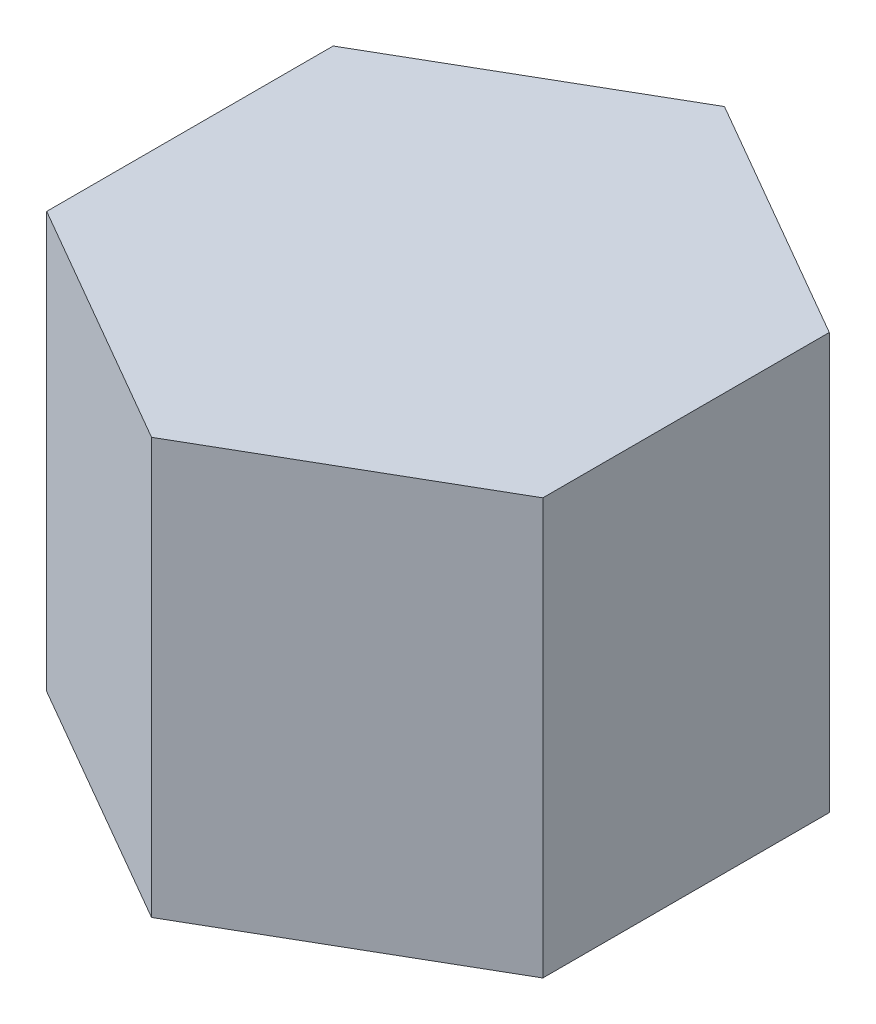
ISO-10303-21;
HEADER;
FILE_DESCRIPTION(('STEP AP214'),'2;1');
FILE_NAME('part.step','',(''),(''),'','','');
FILE_SCHEMA(('AUTOMOTIVE_DESIGN { 1 0 10303 214 1 1 1 1 }'));
ENDSEC;
DATA;
#1=APPLICATION_CONTEXT('core data for automotive mechanical design processes');
#2=APPLICATION_PROTOCOL_DEFINITION('international standard','automotive_design',2000,#1);
#3=PRODUCT_CONTEXT('',#1,'mechanical');
#4=PRODUCT('Part','Part','',(#3));
#5=PRODUCT_RELATED_PRODUCT_CATEGORY('part','',(#4));
#6=PRODUCT_DEFINITION_FORMATION('','',#4);
#7=PRODUCT_DEFINITION_CONTEXT('part definition',#1,'design');
#8=PRODUCT_DEFINITION('design','',#6,#7);
#9=PRODUCT_DEFINITION_SHAPE('','',#8);
#10=(LENGTH_UNIT() NAMED_UNIT(*) SI_UNIT(.MILLI.,.METRE.));
#11=(NAMED_UNIT(*) PLANE_ANGLE_UNIT() SI_UNIT($,.RADIAN.));
#12=(NAMED_UNIT(*) SI_UNIT($,.STERADIAN.) SOLID_ANGLE_UNIT());
#13=UNCERTAINTY_MEASURE_WITH_UNIT(LENGTH_MEASURE(1.E-05),#10,'distance_accuracy_value','');
#14=(GEOMETRIC_REPRESENTATION_CONTEXT(3) GLOBAL_UNCERTAINTY_ASSIGNED_CONTEXT((#13)) GLOBAL_UNIT_ASSIGNED_CONTEXT((#10,
#11,#12)) REPRESENTATION_CONTEXT('',''));
#15=CARTESIAN_POINT('',(0.,0.,0.));
#16=DIRECTION('',(0.,0.,1.));
#17=DIRECTION('',(1.,0.,0.));
#18=AXIS2_PLACEMENT_3D('',#15,#16,#17);
#19=CARTESIAN_POINT('',(207.142660308706,-148.537700895744,287.176844201572));
#20=DIRECTION('',(-0.499999999999943,0.,-0.866025403784472));
#21=DIRECTION('',(-0.866025403784472,0.,0.499999999999943));
#22=AXIS2_PLACEMENT_3D('',#19,#20,#21);
#23=PLANE('',#22);
#24=CARTESIAN_POINT('',(206.839551417382,-149.045793579175,287.351844201572));
#25=DIRECTION('',(0.866025403784471,0.,-0.499999999999943));
#26=VECTOR('',#25,1.);
#27=LINE('',#24,#26);
#28=CARTESIAN_POINT('',(206.839551417382,-149.045793579175,287.351844201572));
#29=VERTEX_POINT('',#28);
#30=CARTESIAN_POINT('',(207.142660308706,-149.045793579175,287.176844201572));
#31=VERTEX_POINT('',#30);
#32=EDGE_CURVE('E170',#29,#31,#27,.T.);
#33=ORIENTED_EDGE('',*,*,#32,.T.);
#34=CARTESIAN_POINT('',(207.142660308706,-148.537700895744,287.176844201572));
#35=DIRECTION('',(0.,-1.,0.));
#36=VECTOR('',#35,1.);
#37=LINE('',#34,#36);
#38=CARTESIAN_POINT('',(207.142660308706,-148.537700895744,287.176844201572));
#39=VERTEX_POINT('',#38);
#40=EDGE_CURVE('E35',#39,#31,#37,.T.);
#41=ORIENTED_EDGE('',*,*,#40,.F.);
#42=CARTESIAN_POINT('',(206.839551417382,-148.537700895744,287.351844201572));
#43=DIRECTION('',(0.866025403784471,0.,-0.499999999999943));
#44=VECTOR('',#43,1.);
#45=LINE('',#42,#44);
#46=CARTESIAN_POINT('',(206.839551417382,-148.537700895744,287.351844201572));
#47=VERTEX_POINT('',#46);
#48=EDGE_CURVE('E159',#47,#39,#45,.T.);
#49=ORIENTED_EDGE('',*,*,#48,.F.);
#50=CARTESIAN_POINT('',(206.839551417382,-148.537700895744,287.351844201572));
#51=DIRECTION('',(0.,-1.,0.));
#52=VECTOR('',#51,1.);
#53=LINE('',#50,#52);
#54=EDGE_CURVE('E10',#47,#29,#53,.T.);
#55=ORIENTED_EDGE('',*,*,#54,.T.);
#56=EDGE_LOOP('',(#33,#41,#49,#55));
#57=FACE_BOUND('',#56,.T.);
#58=ADVANCED_FACE('F16',(#57),#23,.F.);
#59=CARTESIAN_POINT('',(206.839551417382,-148.537700895744,287.351844201572));
#60=DIRECTION('',(0.499999999999978,0.,-0.866025403784452));
#61=DIRECTION('',(-0.866025403784452,0.,-0.499999999999978));
#62=AXIS2_PLACEMENT_3D('',#59,#60,#61);
#63=PLANE('',#62);
#64=CARTESIAN_POINT('',(206.536442526057,-149.045793579175,287.176844201572));
#65=DIRECTION('',(0.866025403784452,0.,0.499999999999978));
#66=VECTOR('',#65,1.);
#67=LINE('',#64,#66);
#68=CARTESIAN_POINT('',(206.536442526057,-149.045793579175,287.176844201572));
#69=VERTEX_POINT('',#68);
#70=EDGE_CURVE('E167',#69,#29,#67,.T.);
#71=ORIENTED_EDGE('',*,*,#70,.T.);
#72=ORIENTED_EDGE('',*,*,#54,.F.);
#73=CARTESIAN_POINT('',(206.536442526057,-148.537700895744,287.176844201572));
#74=DIRECTION('',(0.866025403784452,0.,0.499999999999978));
#75=VECTOR('',#74,1.);
#76=LINE('',#73,#75);
#77=CARTESIAN_POINT('',(206.536442526057,-148.537700895744,287.176844201572));
#78=VERTEX_POINT('',#77);
#79=EDGE_CURVE('E156',#78,#47,#76,.T.);
#80=ORIENTED_EDGE('',*,*,#79,.F.);
#81=CARTESIAN_POINT('',(206.536442526057,-148.537700895744,287.176844201572));
#82=DIRECTION('',(0.,-1.,0.));
#83=VECTOR('',#82,1.);
#84=LINE('',#81,#83);
#85=EDGE_CURVE('E27',#78,#69,#84,.T.);
#86=ORIENTED_EDGE('',*,*,#85,.T.);
#87=EDGE_LOOP('',(#71,#72,#80,#86));
#88=FACE_BOUND('',#87,.T.);
#89=ADVANCED_FACE('F189',(#88),#63,.F.);
#90=CARTESIAN_POINT('',(206.536442526057,-148.537700895744,290.831971220494));
#91=DIRECTION('',(1.,0.,0.));
#92=DIRECTION('',(0.,1.,0.));
#93=AXIS2_PLACEMENT_3D('',#90,#91,#92);
#94=PLANE('',#93);
#95=CARTESIAN_POINT('',(206.536442526057,-149.045793579175,286.826844201572));
#96=DIRECTION('',(0.,0.,1.));
#97=VECTOR('',#96,1.);
#98=LINE('',#95,#97);
#99=CARTESIAN_POINT('',(206.536442526057,-149.045793579175,286.826844201572));
#100=VERTEX_POINT('',#99);
#101=EDGE_CURVE('E163',#100,#69,#98,.T.);
#102=ORIENTED_EDGE('',*,*,#101,.T.);
#103=ORIENTED_EDGE('',*,*,#85,.F.);
#104=CARTESIAN_POINT('',(206.536442526057,-148.537700895744,286.826844201572));
#105=DIRECTION('',(0.,0.,1.));
#106=VECTOR('',#105,1.);
#107=LINE('',#104,#106);
#108=CARTESIAN_POINT('',(206.536442526057,-148.537700895744,286.826844201572));
#109=VERTEX_POINT('',#108);
#110=EDGE_CURVE('E106',#109,#78,#107,.T.);
#111=ORIENTED_EDGE('',*,*,#110,.F.);
#112=CARTESIAN_POINT('',(206.536442526057,-148.537700895744,286.826844201572));
#113=DIRECTION('',(0.,-1.,0.));
#114=VECTOR('',#113,1.);
#115=LINE('',#112,#114);
#116=EDGE_CURVE('E94',#109,#100,#115,.T.);
#117=ORIENTED_EDGE('',*,*,#116,.T.);
#118=EDGE_LOOP('',(#102,#103,#111,#117));
#119=FACE_BOUND('',#118,.T.);
#120=ADVANCED_FACE('F198',(#119),#94,.F.);
#121=CARTESIAN_POINT('',(206.536442526057,-148.537700895744,286.826844201572));
#122=DIRECTION('',(0.499999999999978,0.,0.866025403784452));
#123=DIRECTION('',(0.866025403784452,0.,-0.499999999999978));
#124=AXIS2_PLACEMENT_3D('',#121,#122,#123);
#125=PLANE('',#124);
#126=CARTESIAN_POINT('',(206.839551417382,-149.045793579175,286.651844201572));
#127=DIRECTION('',(-0.866025403784452,0.,0.499999999999978));
#128=VECTOR('',#127,1.);
#129=LINE('',#126,#128);
#130=CARTESIAN_POINT('',(206.839551417382,-149.045793579175,286.651844201572));
#131=VERTEX_POINT('',#130);
#132=EDGE_CURVE('E162',#131,#100,#129,.T.);
#133=ORIENTED_EDGE('',*,*,#132,.T.);
#134=ORIENTED_EDGE('',*,*,#116,.F.);
#135=CARTESIAN_POINT('',(206.839551417382,-148.537700895744,286.651844201572));
#136=DIRECTION('',(-0.866025403784452,0.,0.499999999999978));
#137=VECTOR('',#136,1.);
#138=LINE('',#135,#137);
#139=CARTESIAN_POINT('',(206.839551417382,-148.537700895744,286.651844201572));
#140=VERTEX_POINT('',#139);
#141=EDGE_CURVE('E98',#140,#109,#138,.T.);
#142=ORIENTED_EDGE('',*,*,#141,.F.);
#143=CARTESIAN_POINT('',(206.839551417382,-148.537700895744,286.651844201572));
#144=DIRECTION('',(0.,-1.,0.));
#145=VECTOR('',#144,1.);
#146=LINE('',#143,#145);
#147=EDGE_CURVE('E79',#140,#131,#146,.T.);
#148=ORIENTED_EDGE('',*,*,#147,.T.);
#149=EDGE_LOOP('',(#133,#134,#142,#148));
#150=FACE_BOUND('',#149,.T.);
#151=ADVANCED_FACE('F100',(#150),#125,.F.);
#152=CARTESIAN_POINT('',(206.839551417382,-148.537700895744,286.651844201572));
#153=DIRECTION('',(-0.500000000000062,0.,0.866025403784403));
#154=DIRECTION('',(0.866025403784403,0.,0.500000000000062));
#155=AXIS2_PLACEMENT_3D('',#152,#153,#154);
#156=PLANE('',#155);
#157=CARTESIAN_POINT('',(207.142660308706,-149.045793579175,286.826844201572));
#158=DIRECTION('',(-0.866025403784403,0.,-0.500000000000062));
#159=VECTOR('',#158,1.);
#160=LINE('',#157,#159);
#161=CARTESIAN_POINT('',(207.142660308706,-149.045793579175,286.826844201572));
#162=VERTEX_POINT('',#161);
#163=EDGE_CURVE('E88',#162,#131,#160,.T.);
#164=ORIENTED_EDGE('',*,*,#163,.T.);
#165=ORIENTED_EDGE('',*,*,#147,.F.);
#166=CARTESIAN_POINT('',(207.142660308706,-148.537700895744,286.826844201572));
#167=DIRECTION('',(-0.866025403784403,0.,-0.500000000000062));
#168=VECTOR('',#167,1.);
#169=LINE('',#166,#168);
#170=CARTESIAN_POINT('',(207.142660308706,-148.537700895744,286.826844201572));
#171=VERTEX_POINT('',#170);
#172=EDGE_CURVE('E84',#171,#140,#169,.T.);
#173=ORIENTED_EDGE('',*,*,#172,.F.);
#174=CARTESIAN_POINT('',(207.142660308706,-148.537700895744,286.826844201572));
#175=DIRECTION('',(0.,-1.,0.));
#176=VECTOR('',#175,1.);
#177=LINE('',#174,#176);
#178=EDGE_CURVE('E58',#171,#162,#177,.T.);
#179=ORIENTED_EDGE('',*,*,#178,.T.);
#180=EDGE_LOOP('',(#164,#165,#173,#179));
#181=FACE_BOUND('',#180,.T.);
#182=ADVANCED_FACE('F82',(#181),#156,.F.);
#183=CARTESIAN_POINT('',(207.142660308706,-148.537700895744,290.831971220494));
#184=DIRECTION('',(-1.,0.,0.));
#185=DIRECTION('',(0.,-1.,0.));
#186=AXIS2_PLACEMENT_3D('',#183,#184,#185);
#187=PLANE('',#186);
#188=CARTESIAN_POINT('',(207.142660308706,-149.045793579175,287.176844201572));
#189=DIRECTION('',(0.,0.,-1.));
#190=VECTOR('',#189,1.);
#191=LINE('',#188,#190);
#192=EDGE_CURVE('E160',#31,#162,#191,.T.);
#193=ORIENTED_EDGE('',*,*,#192,.T.);
#194=ORIENTED_EDGE('',*,*,#178,.F.);
#195=CARTESIAN_POINT('',(207.142660308706,-148.537700895744,287.176844201572));
#196=DIRECTION('',(0.,0.,-1.));
#197=VECTOR('',#196,1.);
#198=LINE('',#195,#197);
#199=EDGE_CURVE('E112',#39,#171,#198,.T.);
#200=ORIENTED_EDGE('',*,*,#199,.F.);
#201=ORIENTED_EDGE('',*,*,#40,.T.);
#202=EDGE_LOOP('',(#193,#194,#200,#201));
#203=FACE_BOUND('',#202,.T.);
#204=ADVANCED_FACE('F131',(#203),#187,.F.);
#205=CARTESIAN_POINT('',(206.339551417382,-148.537700895744,290.831971220494));
#206=DIRECTION('',(0.,-1.,0.));
#207=DIRECTION('',(1.,0.,0.));
#208=AXIS2_PLACEMENT_3D('',#205,#206,#207);
#209=PLANE('',#208);
#210=ORIENTED_EDGE('',*,*,#48,.T.);
#211=ORIENTED_EDGE('',*,*,#199,.T.);
#212=ORIENTED_EDGE('',*,*,#172,.T.);
#213=ORIENTED_EDGE('',*,*,#141,.T.);
#214=ORIENTED_EDGE('',*,*,#110,.T.);
#215=ORIENTED_EDGE('',*,*,#79,.T.);
#216=EDGE_LOOP('',(#210,#211,#212,#213,#214,#215));
#217=FACE_BOUND('',#216,.T.);
#218=ADVANCED_FACE('F111',(#217),#209,.F.);
#219=CARTESIAN_POINT('',(206.339551417382,-149.045793579175,290.831971220494));
#220=DIRECTION('',(0.,-1.,0.));
#221=DIRECTION('',(1.,0.,0.));
#222=AXIS2_PLACEMENT_3D('',#219,#220,#221);
#223=PLANE('',#222);
#224=ORIENTED_EDGE('',*,*,#32,.F.);
#225=ORIENTED_EDGE('',*,*,#70,.F.);
#226=ORIENTED_EDGE('',*,*,#101,.F.);
#227=ORIENTED_EDGE('',*,*,#132,.F.);
#228=ORIENTED_EDGE('',*,*,#163,.F.);
#229=ORIENTED_EDGE('',*,*,#192,.F.);
#230=EDGE_LOOP('',(#224,#225,#226,#227,#228,#229));
#231=FACE_BOUND('',#230,.T.);
#232=ADVANCED_FACE('F130',(#231),#223,.T.);
#233=CLOSED_SHELL('',(#58,#89,#120,#151,#182,#204,#218,#232));
#234=MANIFOLD_SOLID_BREP('B1',#233);
#235=ADVANCED_BREP_SHAPE_REPRESENTATION('',(#18,#234),#14);
#236=SHAPE_DEFINITION_REPRESENTATION(#9,#235);
ENDSEC;
END-ISO-10303-21;
